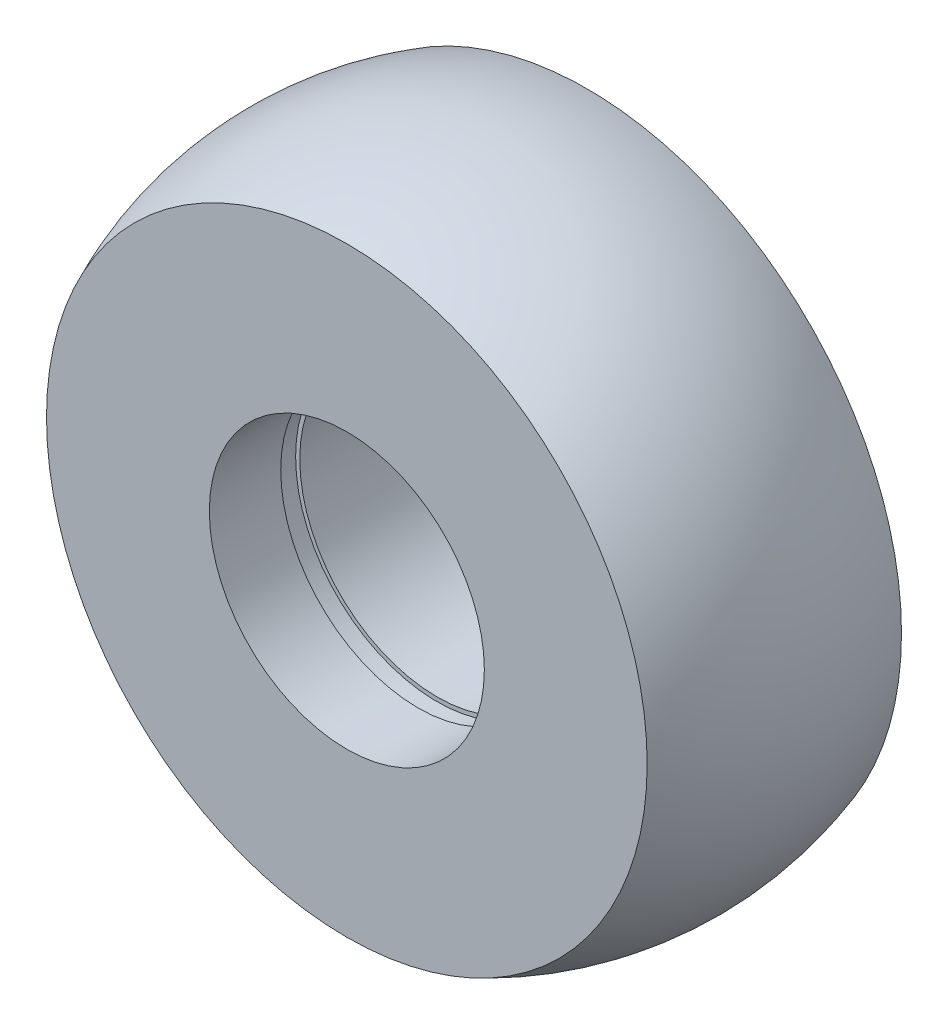
ISO-10303-21;
HEADER;
FILE_DESCRIPTION(('STEP AP214'),'2;1');
FILE_NAME('part.step','',(''),(''),'','','');
FILE_SCHEMA(('AUTOMOTIVE_DESIGN { 1 0 10303 214 1 1 1 1 }'));
ENDSEC;
DATA;
#1=APPLICATION_CONTEXT('core data for automotive mechanical design processes');
#2=APPLICATION_PROTOCOL_DEFINITION('international standard','automotive_design',2000,#1);
#3=PRODUCT_CONTEXT('',#1,'mechanical');
#4=PRODUCT('Part','Part','',(#3));
#5=PRODUCT_RELATED_PRODUCT_CATEGORY('part','',(#4));
#6=PRODUCT_DEFINITION_FORMATION('','',#4);
#7=PRODUCT_DEFINITION_CONTEXT('part definition',#1,'design');
#8=PRODUCT_DEFINITION('design','',#6,#7);
#9=PRODUCT_DEFINITION_SHAPE('','',#8);
#10=(LENGTH_UNIT() NAMED_UNIT(*) SI_UNIT(.MILLI.,.METRE.));
#11=(NAMED_UNIT(*) PLANE_ANGLE_UNIT() SI_UNIT($,.RADIAN.));
#12=(NAMED_UNIT(*) SI_UNIT($,.STERADIAN.) SOLID_ANGLE_UNIT());
#13=UNCERTAINTY_MEASURE_WITH_UNIT(LENGTH_MEASURE(1.E-05),#10,'distance_accuracy_value','');
#14=(GEOMETRIC_REPRESENTATION_CONTEXT(3) GLOBAL_UNCERTAINTY_ASSIGNED_CONTEXT((#13)) GLOBAL_UNIT_ASSIGNED_CONTEXT((#10,
#11,#12)) REPRESENTATION_CONTEXT('',''));
#15=CARTESIAN_POINT('',(0.,0.,0.));
#16=DIRECTION('',(0.,0.,1.));
#17=DIRECTION('',(1.,0.,0.));
#18=AXIS2_PLACEMENT_3D('',#15,#16,#17);
#19=CARTESIAN_POINT('',(-3.93725486444576,0.,4.));
#20=DIRECTION('',(0.,0.,-1.));
#21=DIRECTION('',(-1.,0.,0.));
#22=AXIS2_PLACEMENT_3D('',#19,#20,#21);
#23=PLANE('',#22);
#24=CARTESIAN_POINT('',(0.,0.,4.));
#25=DIRECTION('',(0.,0.,-1.));
#26=DIRECTION('',(-1.,0.,0.));
#27=AXIS2_PLACEMENT_3D('',#24,#25,#26);
#28=CIRCLE('',#27,11.905);
#29=CARTESIAN_POINT('',(-11.905,0.,4.));
#30=VERTEX_POINT('',#29);
#31=EDGE_CURVE('E19',#30,#30,#28,.F.);
#32=ORIENTED_EDGE('',*,*,#31,.T.);
#33=EDGE_LOOP('',(#32));
#34=FACE_BOUND('',#33,.T.);
#35=CARTESIAN_POINT('',(0.,0.,4.));
#36=DIRECTION('',(0.,0.,1.));
#37=DIRECTION('',(1.,0.,0.));
#38=AXIS2_PLACEMENT_3D('',#35,#36,#37);
#39=CIRCLE('',#38,11.556);
#40=CARTESIAN_POINT('',(11.556,0.,4.));
#41=VERTEX_POINT('',#40);
#42=EDGE_CURVE('E41',#41,#41,#39,.F.);
#43=ORIENTED_EDGE('',*,*,#42,.T.);
#44=EDGE_LOOP('',(#43));
#45=FACE_BOUND('',#44,.T.);
#46=ADVANCED_FACE('F15',(#34,#45),#23,.F.);
#47=CARTESIAN_POINT('',(0.,0.,4.8));
#48=DIRECTION('',(0.,0.,-1.));
#49=DIRECTION('',(-1.,0.,0.));
#50=AXIS2_PLACEMENT_3D('',#47,#48,#49);
#51=CYLINDRICAL_SURFACE('',#50,11.905);
#52=ORIENTED_EDGE('',*,*,#31,.F.);
#53=EDGE_LOOP('',(#52));
#54=FACE_BOUND('',#53,.T.);
#55=CARTESIAN_POINT('',(0.,0.,5.6));
#56=DIRECTION('',(0.,0.,-1.));
#57=DIRECTION('',(-1.,0.,0.));
#58=AXIS2_PLACEMENT_3D('',#55,#56,#57);
#59=CIRCLE('',#58,11.905);
#60=CARTESIAN_POINT('',(-11.905,0.,5.6));
#61=VERTEX_POINT('',#60);
#62=EDGE_CURVE('E39',#61,#61,#59,.F.);
#63=ORIENTED_EDGE('',*,*,#62,.T.);
#64=EDGE_LOOP('',(#63));
#65=FACE_BOUND('',#64,.T.);
#66=ADVANCED_FACE('F49',(#54,#65),#51,.F.);
#67=CARTESIAN_POINT('',(0.,0.,-69.5232289298201));
#68=DIRECTION('',(0.,0.,1.));
#69=DIRECTION('',(1.,0.,0.));
#70=AXIS2_PLACEMENT_3D('',#67,#68,#69);
#71=CYLINDRICAL_SURFACE('',#70,11.556);
#72=ORIENTED_EDGE('',*,*,#42,.F.);
#73=EDGE_LOOP('',(#72));
#74=FACE_BOUND('',#73,.T.);
#75=CARTESIAN_POINT('',(0.,0.,-8.6));
#76=DIRECTION('',(0.,0.,1.));
#77=DIRECTION('',(1.,0.,0.));
#78=AXIS2_PLACEMENT_3D('',#75,#76,#77);
#79=CIRCLE('',#78,11.556);
#80=CARTESIAN_POINT('',(11.556,0.,-8.6));
#81=VERTEX_POINT('',#80);
#82=EDGE_CURVE('E36',#81,#81,#79,.F.);
#83=ORIENTED_EDGE('',*,*,#82,.T.);
#84=EDGE_LOOP('',(#83));
#85=FACE_BOUND('',#84,.T.);
#86=ADVANCED_FACE('F52',(#74,#85),#71,.F.);
#87=CARTESIAN_POINT('',(-11.905,0.,5.6));
#88=DIRECTION('',(0.,0.,1.));
#89=DIRECTION('',(1.,0.,0.));
#90=AXIS2_PLACEMENT_3D('',#87,#88,#89);
#91=PLANE('',#90);
#92=ORIENTED_EDGE('',*,*,#62,.F.);
#93=EDGE_LOOP('',(#92));
#94=FACE_BOUND('',#93,.T.);
#95=CARTESIAN_POINT('',(0.,0.,5.60000000000001));
#96=DIRECTION('',(0.,0.,1.));
#97=DIRECTION('',(1.,0.,0.));
#98=AXIS2_PLACEMENT_3D('',#95,#96,#97);
#99=CIRCLE('',#98,11.556);
#100=CARTESIAN_POINT('',(11.556,0.,5.60000000000001));
#101=VERTEX_POINT('',#100);
#102=EDGE_CURVE('E33',#101,#101,#99,.T.);
#103=ORIENTED_EDGE('',*,*,#102,.T.);
#104=EDGE_LOOP('',(#103));
#105=FACE_BOUND('',#104,.T.);
#106=ADVANCED_FACE('F56',(#94,#105),#91,.F.);
#107=CARTESIAN_POINT('',(0.,0.,-8.6));
#108=DIRECTION('',(0.,0.,1.));
#109=DIRECTION('',(1.,0.,0.));
#110=AXIS2_PLACEMENT_3D('',#107,#108,#109);
#111=PLANE('',#110);
#112=CARTESIAN_POINT('',(0.,0.,-8.6));
#113=DIRECTION('',(0.,0.,1.));
#114=DIRECTION('',(1.,0.,0.));
#115=AXIS2_PLACEMENT_3D('',#112,#113,#114);
#116=CIRCLE('',#115,26.413202834946);
#117=CARTESIAN_POINT('',(26.413202834946,0.,-8.6));
#118=VERTEX_POINT('',#117);
#119=EDGE_CURVE('E28',#118,#118,#116,.T.);
#120=ORIENTED_EDGE('',*,*,#119,.F.);
#121=EDGE_LOOP('',(#120));
#122=FACE_BOUND('',#121,.T.);
#123=ORIENTED_EDGE('',*,*,#82,.F.);
#124=EDGE_LOOP('',(#123));
#125=FACE_BOUND('',#124,.T.);
#126=ADVANCED_FACE('F59',(#122,#125),#111,.F.);
#127=CARTESIAN_POINT('',(0.,0.,-69.5232289298201));
#128=DIRECTION('',(0.,0.,1.));
#129=DIRECTION('',(1.,0.,0.));
#130=AXIS2_PLACEMENT_3D('',#127,#128,#129);
#131=CYLINDRICAL_SURFACE('',#130,11.556);
#132=ORIENTED_EDGE('',*,*,#102,.F.);
#133=EDGE_LOOP('',(#132));
#134=FACE_BOUND('',#133,.T.);
#135=CARTESIAN_POINT('',(0.,0.,11.6));
#136=DIRECTION('',(0.,0.,1.));
#137=DIRECTION('',(1.,0.,0.));
#138=AXIS2_PLACEMENT_3D('',#135,#136,#137);
#139=CIRCLE('',#138,11.556);
#140=CARTESIAN_POINT('',(11.556,0.,11.6));
#141=VERTEX_POINT('',#140);
#142=EDGE_CURVE('E23',#141,#141,#139,.F.);
#143=ORIENTED_EDGE('',*,*,#142,.F.);
#144=EDGE_LOOP('',(#143));
#145=FACE_BOUND('',#144,.T.);
#146=ADVANCED_FACE('F63',(#134,#145),#131,.F.);
#147=CARTESIAN_POINT('',(0.,0.,11.6));
#148=DIRECTION('',(0.,0.,1.));
#149=DIRECTION('',(1.,0.,0.));
#150=AXIS2_PLACEMENT_3D('',#147,#148,#149);
#151=PLANE('',#150);
#152=CARTESIAN_POINT('',(0.,0.,11.6));
#153=DIRECTION('',(0.,0.,1.));
#154=DIRECTION('',(1.,0.,0.));
#155=AXIS2_PLACEMENT_3D('',#152,#153,#154);
#156=CIRCLE('',#155,25.2399937400943);
#157=CARTESIAN_POINT('',(25.2399937400943,0.,11.6));
#158=VERTEX_POINT('',#157);
#159=EDGE_CURVE('E10',#158,#158,#156,.F.);
#160=ORIENTED_EDGE('',*,*,#159,.F.);
#161=EDGE_LOOP('',(#160));
#162=FACE_BOUND('',#161,.T.);
#163=ORIENTED_EDGE('',*,*,#142,.T.);
#164=EDGE_LOOP('',(#163));
#165=FACE_BOUND('',#164,.T.);
#166=ADVANCED_FACE('F66',(#162,#165),#151,.T.);
#167=CARTESIAN_POINT('',(0.,0.,0.));
#168=DIRECTION('',(1.,0.,0.));
#169=DIRECTION('',(0.,-1.,0.));
#170=AXIS2_PLACEMENT_3D('',#167,#168,#169);
#171=SPHERICAL_SURFACE('',#170,27.778);
#172=CARTESIAN_POINT('',(0.,0.,0.));
#173=DIRECTION('',(0.,0.,1.));
#174=DIRECTION('',(1.,0.,0.));
#175=AXIS2_PLACEMENT_3D('',#172,#173,#174);
#176=SPHERICAL_SURFACE('',#175,27.778);
#177=ORIENTED_EDGE('',*,*,#159,.T.);
#178=EDGE_LOOP('',(#177));
#179=FACE_BOUND('',#178,.T.);
#180=ORIENTED_EDGE('',*,*,#119,.T.);
#181=EDGE_LOOP('',(#180));
#182=FACE_BOUND('',#181,.T.);
#183=ADVANCED_FACE('F17',(#179,#182),#176,.T.);
#184=CLOSED_SHELL('',(#46,#66,#86,#106,#126,#146,#166,#183));
#185=MANIFOLD_SOLID_BREP('B1',#184);
#186=ADVANCED_BREP_SHAPE_REPRESENTATION('',(#18,#185),#14);
#187=SHAPE_DEFINITION_REPRESENTATION(#9,#186);
ENDSEC;
END-ISO-10303-21;
